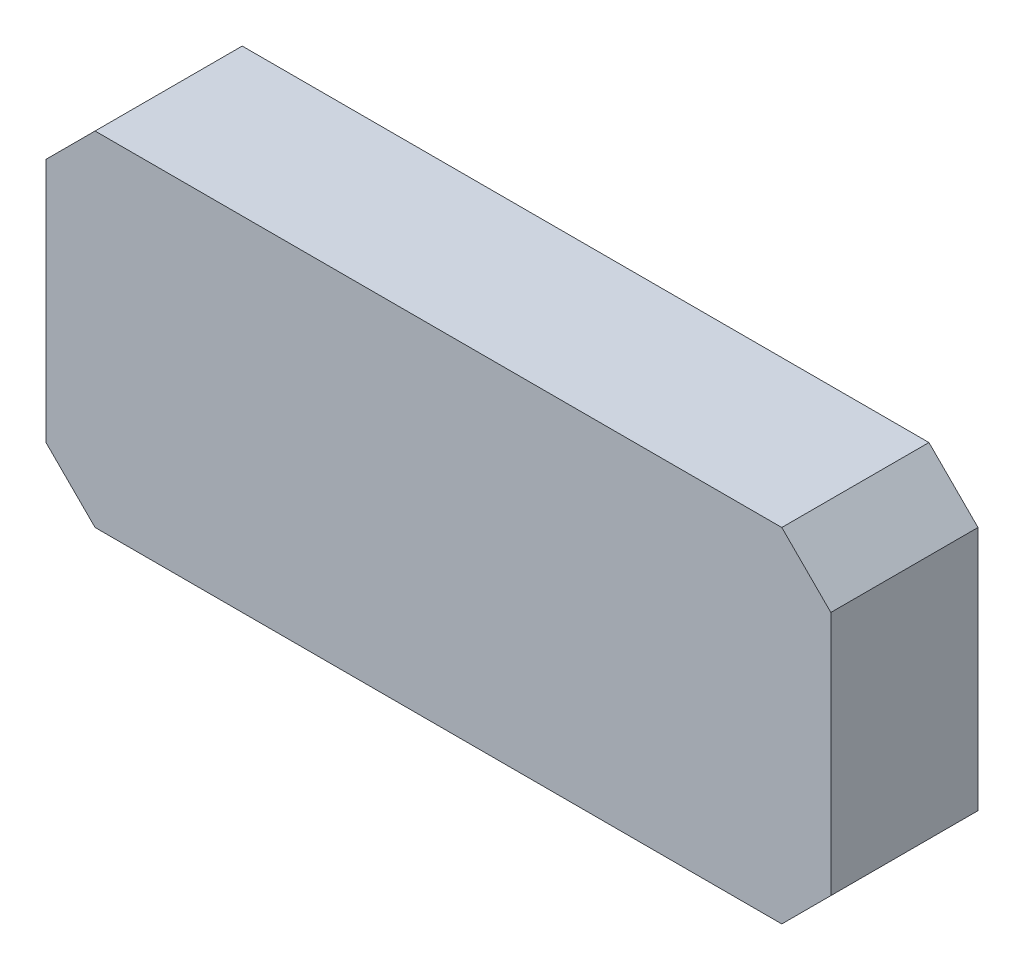
ISO-10303-21;
HEADER;
FILE_DESCRIPTION(('STEP AP214'),'2;1');
FILE_NAME('part.step','',(''),(''),'','','');
FILE_SCHEMA(('AUTOMOTIVE_DESIGN { 1 0 10303 214 1 1 1 1 }'));
ENDSEC;
DATA;
#1=APPLICATION_CONTEXT('core data for automotive mechanical design processes');
#2=APPLICATION_PROTOCOL_DEFINITION('international standard','automotive_design',2000,#1);
#3=PRODUCT_CONTEXT('',#1,'mechanical');
#4=PRODUCT('Part','Part','',(#3));
#5=PRODUCT_RELATED_PRODUCT_CATEGORY('part','',(#4));
#6=PRODUCT_DEFINITION_FORMATION('','',#4);
#7=PRODUCT_DEFINITION_CONTEXT('part definition',#1,'design');
#8=PRODUCT_DEFINITION('design','',#6,#7);
#9=PRODUCT_DEFINITION_SHAPE('','',#8);
#10=(LENGTH_UNIT() NAMED_UNIT(*) SI_UNIT(.MILLI.,.METRE.));
#11=(NAMED_UNIT(*) PLANE_ANGLE_UNIT() SI_UNIT($,.RADIAN.));
#12=(NAMED_UNIT(*) SI_UNIT($,.STERADIAN.) SOLID_ANGLE_UNIT());
#13=UNCERTAINTY_MEASURE_WITH_UNIT(LENGTH_MEASURE(1.E-05),#10,'distance_accuracy_value','');
#14=(GEOMETRIC_REPRESENTATION_CONTEXT(3) GLOBAL_UNCERTAINTY_ASSIGNED_CONTEXT((#13)) GLOBAL_UNIT_ASSIGNED_CONTEXT((#10,
#11,#12)) REPRESENTATION_CONTEXT('',''));
#15=CARTESIAN_POINT('',(0.,0.,0.));
#16=DIRECTION('',(0.,0.,1.));
#17=DIRECTION('',(1.,0.,0.));
#18=AXIS2_PLACEMENT_3D('',#15,#16,#17);
#19=CARTESIAN_POINT('',(-8.,-3.,3.));
#20=DIRECTION('',(1.,0.,0.));
#21=DIRECTION('',(0.,0.,-1.));
#22=AXIS2_PLACEMENT_3D('',#19,#20,#21);
#23=PLANE('',#22);
#24=DIRECTION('',(0.,-1.,0.));
#25=VECTOR('',#24,1.);
#26=CARTESIAN_POINT('',(-8.,-3.,0.));
#27=LINE('',#26,#25);
#28=CARTESIAN_POINT('',(-8.,3.,0.));
#29=VERTEX_POINT('',#28);
#30=CARTESIAN_POINT('',(-8.,-2.,0.));
#31=VERTEX_POINT('',#30);
#32=EDGE_CURVE('E127',#29,#31,#27,.T.);
#33=ORIENTED_EDGE('',*,*,#32,.T.);
#34=DIRECTION('',(0.,0.,1.));
#35=VECTOR('',#34,1.);
#36=CARTESIAN_POINT('',(-8.,-2.,3.));
#37=LINE('',#36,#35);
#38=CARTESIAN_POINT('',(-8.,-2.,3.));
#39=VERTEX_POINT('',#38);
#40=EDGE_CURVE('E104',#31,#39,#37,.T.);
#41=ORIENTED_EDGE('',*,*,#40,.T.);
#42=DIRECTION('',(0.,-1.,0.));
#43=VECTOR('',#42,1.);
#44=CARTESIAN_POINT('',(-8.,-3.,3.));
#45=LINE('',#44,#43);
#46=CARTESIAN_POINT('',(-8.,3.,3.));
#47=VERTEX_POINT('',#46);
#48=EDGE_CURVE('E136',#47,#39,#45,.T.);
#49=ORIENTED_EDGE('',*,*,#48,.F.);
#50=DIRECTION('',(0.,0.,-1.));
#51=VECTOR('',#50,1.);
#52=CARTESIAN_POINT('',(-8.,3.,3.));
#53=LINE('',#52,#51);
#54=EDGE_CURVE('E109',#47,#29,#53,.T.);
#55=ORIENTED_EDGE('',*,*,#54,.T.);
#56=EDGE_LOOP('',(#33,#41,#49,#55));
#57=FACE_BOUND('',#56,.T.);
#58=ADVANCED_FACE('F32',(#57),#23,.F.);
#59=CARTESIAN_POINT('',(-8.,-3.,3.));
#60=DIRECTION('',(0.,1.,0.));
#61=DIRECTION('',(0.,0.,1.));
#62=AXIS2_PLACEMENT_3D('',#59,#60,#61);
#63=PLANE('',#62);
#64=DIRECTION('',(1.,0.,0.));
#65=VECTOR('',#64,1.);
#66=CARTESIAN_POINT('',(-8.,-3.,3.));
#67=LINE('',#66,#65);
#68=CARTESIAN_POINT('',(-7.,-3.,3.));
#69=VERTEX_POINT('',#68);
#70=CARTESIAN_POINT('',(7.,-3.,3.));
#71=VERTEX_POINT('',#70);
#72=EDGE_CURVE('E119',#69,#71,#67,.T.);
#73=ORIENTED_EDGE('',*,*,#72,.F.);
#74=DIRECTION('',(0.,0.,-1.));
#75=VECTOR('',#74,1.);
#76=CARTESIAN_POINT('',(-7.,-3.,3.));
#77=LINE('',#76,#75);
#78=CARTESIAN_POINT('',(-7.,-3.,0.));
#79=VERTEX_POINT('',#78);
#80=EDGE_CURVE('E103',#69,#79,#77,.T.);
#81=ORIENTED_EDGE('',*,*,#80,.T.);
#82=DIRECTION('',(1.,0.,0.));
#83=VECTOR('',#82,1.);
#84=CARTESIAN_POINT('',(-8.,-3.,0.));
#85=LINE('',#84,#83);
#86=CARTESIAN_POINT('',(7.,-3.,0.));
#87=VERTEX_POINT('',#86);
#88=EDGE_CURVE('E116',#79,#87,#85,.T.);
#89=ORIENTED_EDGE('',*,*,#88,.T.);
#90=DIRECTION('',(0.,0.,1.));
#91=VECTOR('',#90,1.);
#92=CARTESIAN_POINT('',(7.,-3.,3.));
#93=LINE('',#92,#91);
#94=EDGE_CURVE('E121',#87,#71,#93,.T.);
#95=ORIENTED_EDGE('',*,*,#94,.T.);
#96=EDGE_LOOP('',(#73,#81,#89,#95));
#97=FACE_BOUND('',#96,.T.);
#98=ADVANCED_FACE('F115',(#97),#63,.F.);
#99=CARTESIAN_POINT('',(8.,-3.,3.));
#100=DIRECTION('',(-1.,0.,0.));
#101=DIRECTION('',(0.,0.,1.));
#102=AXIS2_PLACEMENT_3D('',#99,#100,#101);
#103=PLANE('',#102);
#104=DIRECTION('',(0.,1.,0.));
#105=VECTOR('',#104,1.);
#106=CARTESIAN_POINT('',(8.,-3.,3.));
#107=LINE('',#106,#105);
#108=CARTESIAN_POINT('',(8.,-2.,3.));
#109=VERTEX_POINT('',#108);
#110=CARTESIAN_POINT('',(8.,2.99999999999999,3.));
#111=VERTEX_POINT('',#110);
#112=EDGE_CURVE('E159',#109,#111,#107,.T.);
#113=ORIENTED_EDGE('',*,*,#112,.F.);
#114=DIRECTION('',(0.,0.,-1.));
#115=VECTOR('',#114,1.);
#116=CARTESIAN_POINT('',(8.,-2.,3.));
#117=LINE('',#116,#115);
#118=CARTESIAN_POINT('',(8.,-2.,0.));
#119=VERTEX_POINT('',#118);
#120=EDGE_CURVE('E11',#109,#119,#117,.T.);
#121=ORIENTED_EDGE('',*,*,#120,.T.);
#122=DIRECTION('',(0.,1.,0.));
#123=VECTOR('',#122,1.);
#124=CARTESIAN_POINT('',(8.,-3.,0.));
#125=LINE('',#124,#123);
#126=CARTESIAN_POINT('',(8.,2.99999999999999,0.));
#127=VERTEX_POINT('',#126);
#128=EDGE_CURVE('E126',#119,#127,#125,.T.);
#129=ORIENTED_EDGE('',*,*,#128,.T.);
#130=DIRECTION('',(0.,0.,1.));
#131=VECTOR('',#130,1.);
#132=CARTESIAN_POINT('',(8.,2.99999999999999,3.));
#133=LINE('',#132,#131);
#134=EDGE_CURVE('E40',#127,#111,#133,.T.);
#135=ORIENTED_EDGE('',*,*,#134,.T.);
#136=EDGE_LOOP('',(#113,#121,#129,#135));
#137=FACE_BOUND('',#136,.T.);
#138=ADVANCED_FACE('F158',(#137),#103,.F.);
#139=CARTESIAN_POINT('',(-8.,4.,3.));
#140=DIRECTION('',(0.,-1.,0.));
#141=DIRECTION('',(0.,0.,-1.));
#142=AXIS2_PLACEMENT_3D('',#139,#140,#141);
#143=PLANE('',#142);
#144=DIRECTION('',(-1.,0.,0.));
#145=VECTOR('',#144,1.);
#146=CARTESIAN_POINT('',(-8.,4.,0.));
#147=LINE('',#146,#145);
#148=CARTESIAN_POINT('',(6.99999999999999,4.,0.));
#149=VERTEX_POINT('',#148);
#150=CARTESIAN_POINT('',(-7.,4.,0.));
#151=VERTEX_POINT('',#150);
#152=EDGE_CURVE('E130',#149,#151,#147,.T.);
#153=ORIENTED_EDGE('',*,*,#152,.T.);
#154=DIRECTION('',(0.,0.,1.));
#155=VECTOR('',#154,1.);
#156=CARTESIAN_POINT('',(-7.,4.,3.));
#157=LINE('',#156,#155);
#158=CARTESIAN_POINT('',(-7.,4.,3.));
#159=VERTEX_POINT('',#158);
#160=EDGE_CURVE('E47',#151,#159,#157,.T.);
#161=ORIENTED_EDGE('',*,*,#160,.T.);
#162=DIRECTION('',(-1.,0.,0.));
#163=VECTOR('',#162,1.);
#164=CARTESIAN_POINT('',(-8.,4.,3.));
#165=LINE('',#164,#163);
#166=CARTESIAN_POINT('',(7.,4.,3.));
#167=VERTEX_POINT('',#166);
#168=EDGE_CURVE('E137',#167,#159,#165,.T.);
#169=ORIENTED_EDGE('',*,*,#168,.F.);
#170=DIRECTION('',(0.,0.,-1.));
#171=VECTOR('',#170,1.);
#172=CARTESIAN_POINT('',(7.,4.,3.));
#173=LINE('',#172,#171);
#174=EDGE_CURVE('E152',#167,#149,#173,.T.);
#175=ORIENTED_EDGE('',*,*,#174,.T.);
#176=EDGE_LOOP('',(#153,#161,#169,#175));
#177=FACE_BOUND('',#176,.T.);
#178=ADVANCED_FACE('F168',(#177),#143,.F.);
#179=CARTESIAN_POINT('',(-8.,4.,3.));
#180=DIRECTION('',(0.,0.,-1.));
#181=DIRECTION('',(-1.,0.,0.));
#182=AXIS2_PLACEMENT_3D('',#179,#180,#181);
#183=PLANE('',#182);
#184=ORIENTED_EDGE('',*,*,#48,.T.);
#185=DIRECTION('',(-0.707106781186547,0.707106781186548,0.));
#186=VECTOR('',#185,1.);
#187=CARTESIAN_POINT('',(-7.,-3.,3.));
#188=LINE('',#187,#186);
#189=EDGE_CURVE('E150',#39,#69,#188,.F.);
#190=ORIENTED_EDGE('',*,*,#189,.T.);
#191=ORIENTED_EDGE('',*,*,#72,.T.);
#192=DIRECTION('',(-0.707106781186548,-0.707106781186548,0.));
#193=VECTOR('',#192,1.);
#194=CARTESIAN_POINT('',(8.,-2.,3.));
#195=LINE('',#194,#193);
#196=EDGE_CURVE('E146',#71,#109,#195,.F.);
#197=ORIENTED_EDGE('',*,*,#196,.T.);
#198=ORIENTED_EDGE('',*,*,#112,.T.);
#199=DIRECTION('',(0.707106781186547,-0.707106781186548,0.));
#200=VECTOR('',#199,1.);
#201=CARTESIAN_POINT('',(7.,4.,3.));
#202=LINE('',#201,#200);
#203=EDGE_CURVE('E54',#111,#167,#202,.F.);
#204=ORIENTED_EDGE('',*,*,#203,.T.);
#205=ORIENTED_EDGE('',*,*,#168,.T.);
#206=DIRECTION('',(0.707106781186548,0.707106781186547,0.));
#207=VECTOR('',#206,1.);
#208=CARTESIAN_POINT('',(-8.,3.,3.));
#209=LINE('',#208,#207);
#210=EDGE_CURVE('E148',#159,#47,#209,.F.);
#211=ORIENTED_EDGE('',*,*,#210,.T.);
#212=EDGE_LOOP('',(#184,#190,#191,#197,#198,#204,#205,#211));
#213=FACE_BOUND('',#212,.T.);
#214=ADVANCED_FACE('F163',(#213),#183,.F.);
#215=CARTESIAN_POINT('',(-8.,4.,0.));
#216=DIRECTION('',(0.,0.,-1.));
#217=DIRECTION('',(-1.,0.,0.));
#218=AXIS2_PLACEMENT_3D('',#215,#216,#217);
#219=PLANE('',#218);
#220=ORIENTED_EDGE('',*,*,#88,.F.);
#221=DIRECTION('',(0.707106781186547,-0.707106781186548,0.));
#222=VECTOR('',#221,1.);
#223=CARTESIAN_POINT('',(-11.,1.00000000000001,0.));
#224=LINE('',#223,#222);
#225=EDGE_CURVE('E99',#79,#31,#224,.F.);
#226=ORIENTED_EDGE('',*,*,#225,.T.);
#227=ORIENTED_EDGE('',*,*,#32,.F.);
#228=DIRECTION('',(-0.707106781186548,-0.707106781186547,0.));
#229=VECTOR('',#228,1.);
#230=CARTESIAN_POINT('',(-7.5,3.5,0.));
#231=LINE('',#230,#229);
#232=EDGE_CURVE('E110',#29,#151,#231,.F.);
#233=ORIENTED_EDGE('',*,*,#232,.T.);
#234=ORIENTED_EDGE('',*,*,#152,.F.);
#235=DIRECTION('',(-0.707106781186547,0.707106781186548,0.));
#236=VECTOR('',#235,1.);
#237=CARTESIAN_POINT('',(-0.499999999999987,11.5,0.));
#238=LINE('',#237,#236);
#239=EDGE_CURVE('E120',#149,#127,#238,.F.);
#240=ORIENTED_EDGE('',*,*,#239,.T.);
#241=ORIENTED_EDGE('',*,*,#128,.F.);
#242=DIRECTION('',(0.707106781186548,0.707106781186548,0.));
#243=VECTOR('',#242,1.);
#244=CARTESIAN_POINT('',(3.,-7.,0.));
#245=LINE('',#244,#243);
#246=EDGE_CURVE('E125',#119,#87,#245,.F.);
#247=ORIENTED_EDGE('',*,*,#246,.T.);
#248=EDGE_LOOP('',(#220,#226,#227,#233,#234,#240,#241,#247));
#249=FACE_BOUND('',#248,.T.);
#250=ADVANCED_FACE('F123',(#249),#219,.T.);
#251=CARTESIAN_POINT('',(-7.,-3.,3.));
#252=DIRECTION('',(0.707106781186548,0.707106781186547,0.));
#253=DIRECTION('',(-0.707106781186547,0.707106781186548,0.));
#254=AXIS2_PLACEMENT_3D('',#251,#252,#253);
#255=PLANE('',#254);
#256=ORIENTED_EDGE('',*,*,#189,.F.);
#257=ORIENTED_EDGE('',*,*,#40,.F.);
#258=ORIENTED_EDGE('',*,*,#225,.F.);
#259=ORIENTED_EDGE('',*,*,#80,.F.);
#260=EDGE_LOOP('',(#256,#257,#258,#259));
#261=FACE_BOUND('',#260,.T.);
#262=ADVANCED_FACE('F102',(#261),#255,.F.);
#263=CARTESIAN_POINT('',(-8.,3.,3.));
#264=DIRECTION('',(0.707106781186547,-0.707106781186548,0.));
#265=DIRECTION('',(0.707106781186548,0.707106781186547,0.));
#266=AXIS2_PLACEMENT_3D('',#263,#264,#265);
#267=PLANE('',#266);
#268=ORIENTED_EDGE('',*,*,#210,.F.);
#269=ORIENTED_EDGE('',*,*,#160,.F.);
#270=ORIENTED_EDGE('',*,*,#232,.F.);
#271=ORIENTED_EDGE('',*,*,#54,.F.);
#272=EDGE_LOOP('',(#268,#269,#270,#271));
#273=FACE_BOUND('',#272,.T.);
#274=ADVANCED_FACE('F172',(#273),#267,.F.);
#275=CARTESIAN_POINT('',(8.,-2.,3.));
#276=DIRECTION('',(-0.707106781186548,0.707106781186548,0.));
#277=DIRECTION('',(-0.707106781186548,-0.707106781186548,0.));
#278=AXIS2_PLACEMENT_3D('',#275,#276,#277);
#279=PLANE('',#278);
#280=ORIENTED_EDGE('',*,*,#196,.F.);
#281=ORIENTED_EDGE('',*,*,#94,.F.);
#282=ORIENTED_EDGE('',*,*,#246,.F.);
#283=ORIENTED_EDGE('',*,*,#120,.F.);
#284=EDGE_LOOP('',(#280,#281,#282,#283));
#285=FACE_BOUND('',#284,.T.);
#286=ADVANCED_FACE('F178',(#285),#279,.F.);
#287=CARTESIAN_POINT('',(7.,4.,3.));
#288=DIRECTION('',(-0.707106781186548,-0.707106781186547,0.));
#289=DIRECTION('',(0.707106781186547,-0.707106781186548,0.));
#290=AXIS2_PLACEMENT_3D('',#287,#288,#289);
#291=PLANE('',#290);
#292=ORIENTED_EDGE('',*,*,#203,.F.);
#293=ORIENTED_EDGE('',*,*,#134,.F.);
#294=ORIENTED_EDGE('',*,*,#239,.F.);
#295=ORIENTED_EDGE('',*,*,#174,.F.);
#296=EDGE_LOOP('',(#292,#293,#294,#295));
#297=FACE_BOUND('',#296,.T.);
#298=ADVANCED_FACE('F34',(#297),#291,.F.);
#299=CLOSED_SHELL('',(#58,#98,#138,#178,#214,#250,#262,#274,#286,#298));
#300=MANIFOLD_SOLID_BREP('B2',#299);
#301=ADVANCED_BREP_SHAPE_REPRESENTATION('',(#18,#300),#14);
#302=SHAPE_DEFINITION_REPRESENTATION(#9,#301);
ENDSEC;
END-ISO-10303-21;
